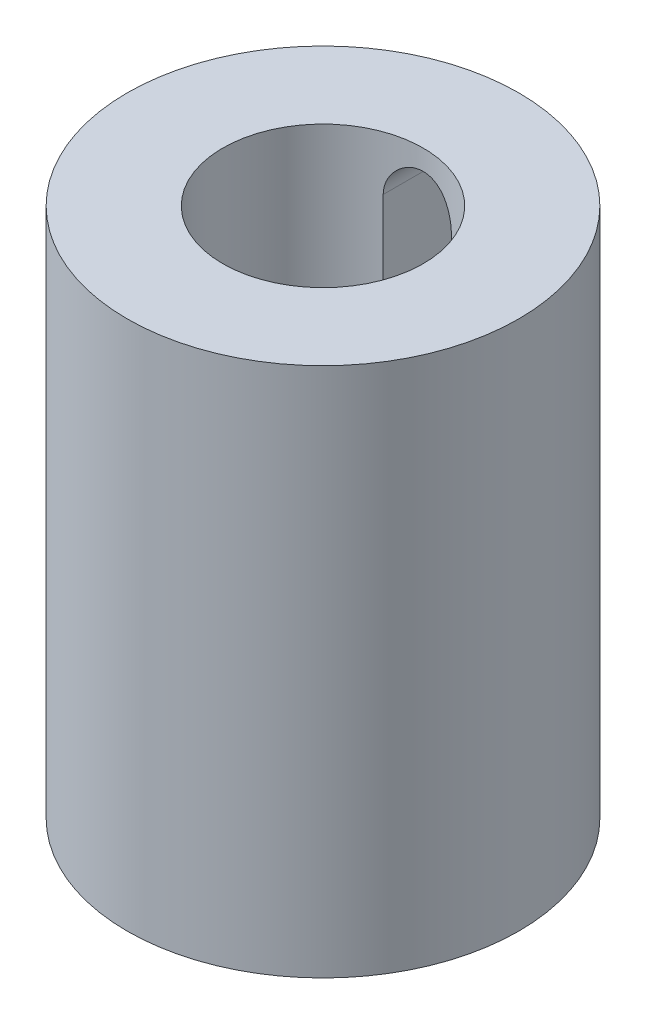
ISO-10303-21;
HEADER;
FILE_DESCRIPTION(('STEP AP214'),'2;1');
FILE_NAME('part.step','',(''),(''),'','','');
FILE_SCHEMA(('AUTOMOTIVE_DESIGN { 1 0 10303 214 1 1 1 1 }'));
ENDSEC;
DATA;
#1=APPLICATION_CONTEXT('core data for automotive mechanical design processes');
#2=APPLICATION_PROTOCOL_DEFINITION('international standard','automotive_design',2000,#1);
#3=PRODUCT_CONTEXT('',#1,'mechanical');
#4=PRODUCT('Part','Part','',(#3));
#5=PRODUCT_RELATED_PRODUCT_CATEGORY('part','',(#4));
#6=PRODUCT_DEFINITION_FORMATION('','',#4);
#7=PRODUCT_DEFINITION_CONTEXT('part definition',#1,'design');
#8=PRODUCT_DEFINITION('design','',#6,#7);
#9=PRODUCT_DEFINITION_SHAPE('','',#8);
#10=(LENGTH_UNIT() NAMED_UNIT(*) SI_UNIT(.MILLI.,.METRE.));
#11=(NAMED_UNIT(*) PLANE_ANGLE_UNIT() SI_UNIT($,.RADIAN.));
#12=(NAMED_UNIT(*) SI_UNIT($,.STERADIAN.) SOLID_ANGLE_UNIT());
#13=UNCERTAINTY_MEASURE_WITH_UNIT(LENGTH_MEASURE(1.E-05),#10,'distance_accuracy_value','');
#14=(GEOMETRIC_REPRESENTATION_CONTEXT(3) GLOBAL_UNCERTAINTY_ASSIGNED_CONTEXT((#13)) GLOBAL_UNIT_ASSIGNED_CONTEXT((#10,
#11,#12)) REPRESENTATION_CONTEXT('',''));
#15=CARTESIAN_POINT('',(0.,0.,0.));
#16=DIRECTION('',(0.,0.,1.));
#17=DIRECTION('',(1.,0.,0.));
#18=AXIS2_PLACEMENT_3D('',#15,#16,#17);
#19=CARTESIAN_POINT('',(0.,46.0659340659341,0.));
#20=DIRECTION('',(0.,1.,0.));
#21=DIRECTION('',(0.,0.,1.));
#22=AXIS2_PLACEMENT_3D('',#19,#20,#21);
#23=CYLINDRICAL_SURFACE('',#22,15.1208791208791);
#24=DIRECTION('',(0.,1.,0.));
#25=VECTOR('',#24,1.);
#26=CARTESIAN_POINT('',(-5.14000102900412,46.0659340659341,-14.2204562096325));
#27=LINE('',#26,#25);
#28=CARTESIAN_POINT('',(-5.14000102900412,-27.1299059130508,-14.2204562096325));
#29=VERTEX_POINT('',#28);
#30=CARTESIAN_POINT('',(-5.14000102900412,37.869690432897,-14.2204562096325));
#31=VERTEX_POINT('',#30);
#32=EDGE_CURVE('E146',#29,#31,#27,.T.);
#33=ORIENTED_EDGE('',*,*,#32,.T.);
#34=CARTESIAN_POINT('',(-5.14000102900412,37.869690432897,-14.2204562096325));
#35=CARTESIAN_POINT('',(-5.14002102747468,38.0097456835956,-14.2204326730949));
#36=CARTESIAN_POINT('',(-5.13427755583523,38.1497917412132,-14.2225245124609));
#37=CARTESIAN_POINT('',(-5.11141314304525,38.4287937767093,-14.2307663990674));
#38=CARTESIAN_POINT('',(-5.09429538339667,38.5677500484181,-14.2369153115006));
#39=CARTESIAN_POINT('',(-5.04890085093638,38.8431608208899,-14.2530743677835));
#40=CARTESIAN_POINT('',(-5.02065817662554,38.979621645345,-14.2630727108123));
#41=CARTESIAN_POINT('',(-4.95328564871349,39.2495156104828,-14.2866100569386));
#42=CARTESIAN_POINT('',(-4.91415537816541,39.3829486350024,-14.3001491956318));
#43=CARTESIAN_POINT('',(-4.82538320930365,39.6457832974603,-14.330347301387));
#44=CARTESIAN_POINT('',(-4.77575029456977,39.7751882730172,-14.3470036007445));
#45=CARTESIAN_POINT('',(-4.6663614594846,40.029283976328,-14.3829540597943));
#46=CARTESIAN_POINT('',(-4.60660175959951,40.1539729226274,-14.4022492038396));
#47=CARTESIAN_POINT('',(-4.4127400429123,40.5198620039076,-14.4633017502006));
#48=CARTESIAN_POINT('',(-4.26402041493811,40.7529873304385,-14.5082387607293));
#49=CARTESIAN_POINT('',(-3.92561913127901,41.1999558273327,-14.6035076613199));
#50=CARTESIAN_POINT('',(-3.73463306729003,41.4127756385541,-14.6539771166196));
#51=CARTESIAN_POINT('',(-3.31982835608129,41.8041059012354,-14.7534796862771));
#52=CARTESIAN_POINT('',(-3.09600380511982,41.9826101700474,-14.8025125404556));
#53=CARTESIAN_POINT('',(-2.61436226279878,42.3048828419447,-14.8952264182547));
#54=CARTESIAN_POINT('',(-2.35578477538183,42.4475713140269,-14.93872504509));
#55=CARTESIAN_POINT('',(-1.81657139185364,42.6870150509466,-15.013827194864));
#56=CARTESIAN_POINT('',(-1.53594248918091,42.7837848105721,-15.0454344707955));
#57=CARTESIAN_POINT('',(-0.971326294640556,42.9251577160523,-15.0922106594478));
#58=CARTESIAN_POINT('',(-0.687825089352467,42.9715163009993,-15.1079312846667));
#59=CARTESIAN_POINT('',(-0.116655283981176,43.0163402400381,-15.1231248153739));
#60=CARTESIAN_POINT('',(0.17101226219471,43.0148175016558,-15.1226017604763));
#61=CARTESIAN_POINT('',(0.729890627241207,42.9650198309119,-15.1057366447944));
#62=CARTESIAN_POINT('',(1.00129422534417,42.918653533909,-15.0900404001605));
#63=CARTESIAN_POINT('',(1.53220659944929,42.7836493874731,-15.0454090760822));
#64=CARTESIAN_POINT('',(1.79171471045486,42.6950091779417,-15.0164732574929));
#65=CARTESIAN_POINT('',(2.29557211653941,42.4768974815611,-14.9478061617687));
#66=CARTESIAN_POINT('',(2.53967137277207,42.3468942268727,-14.907935279212));
#67=CARTESIAN_POINT('',(3.00314737485387,42.0501770156733,-14.8215299353922));
#68=CARTESIAN_POINT('',(3.22251714533484,41.8834527403556,-14.7749936023892));
#69=CARTESIAN_POINT('',(3.64160886564896,41.5085354750811,-14.6774736065265));
#70=CARTESIAN_POINT('',(3.8398513722678,41.2987169525339,-14.6263837334253));
#71=CARTESIAN_POINT('',(4.19892272918298,40.8482026909545,-14.527381935341));
#72=CARTESIAN_POINT('',(4.35973917195641,40.6074967530099,-14.4794710680172));
#73=CARTESIAN_POINT('',(4.57041143630591,40.2260842636933,-14.4138074667288));
#74=CARTESIAN_POINT('',(4.63595646841574,40.0943734095877,-14.3928056388513));
#75=CARTESIAN_POINT('',(4.75564308994047,39.8254739464858,-14.3537037021023));
#76=CARTESIAN_POINT('',(4.80978944310016,39.6882876544182,-14.3356023818069));
#77=CARTESIAN_POINT('',(4.90613528516274,39.4095525301411,-14.3029162289376));
#78=CARTESIAN_POINT('',(4.94834788681859,39.2680086772034,-14.2883275393364));
#79=CARTESIAN_POINT('',(5.02048027601976,38.9815330159393,-14.2631418908777));
#80=CARTESIAN_POINT('',(5.05040566601571,38.8366027835902,-14.2525431129724));
#81=CARTESIAN_POINT('',(5.09596608253602,38.5549576530151,-14.236315771625));
#82=CARTESIAN_POINT('',(5.11247341077117,38.4184007077077,-14.2303848044642));
#83=CARTESIAN_POINT('',(5.13449289118933,38.1444629008288,-14.2224467495793));
#84=CARTESIAN_POINT('',(5.14001872716455,38.0070832788664,-14.2204347785439));
#85=CARTESIAN_POINT('',(5.14000102900412,37.869690432897,-14.2204562096325));
#86=B_SPLINE_CURVE_WITH_KNOTS('',3,(#34,#35,#36,#37,#38,#39,#40,#41,#42,#43,#44,#45,#46,#47,#48,
#49,#50,#51,#52,#53,#54,#55,#56,#57,#58,#59,#60,#61,#62,#63,#64,#65,#66,#67,#68,#69,#70,#71,#72,
#73,#74,#75,#76,#77,#78,#79,#80,#81,#82,#83,#84,#85),.UNSPECIFIED.,.F.,.F.,(4,2,2,2,2,2,2,2,2,2,
2,2,2,2,2,2,2,2,2,2,2,2,2,2,2,4),(0.,0.420018055227185,0.83991867663599,1.25854216990599,
1.67718169681495,2.09546457181133,2.513903904184,3.35045811329579,4.21775315299354,
5.08520430751073,5.97630965983812,6.8671335367256,7.72583148546545,8.58431588774411,
9.40779956365253,10.231329218985,11.0659058423869,11.9007172862593,12.7762311988733,
13.6520349505029,14.097397052609,14.5425726575062,14.9872571871659,15.4317387336603,
15.8442830974467,16.2563130757805),.UNSPECIFIED.);
#87=CARTESIAN_POINT('',(5.14000102900412,37.869690432897,-14.2204562096325));
#88=VERTEX_POINT('',#87);
#89=EDGE_CURVE('E86',#31,#88,#86,.T.);
#90=ORIENTED_EDGE('',*,*,#89,.T.);
#91=DIRECTION('',(0.,1.,0.));
#92=VECTOR('',#91,1.);
#93=CARTESIAN_POINT('',(5.14000102900412,46.0659340659341,-14.2204562096325));
#94=LINE('',#93,#92);
#95=CARTESIAN_POINT('',(5.14000102900412,-27.1299059130508,-14.2204562096325));
#96=VERTEX_POINT('',#95);
#97=EDGE_CURVE('E118',#88,#96,#94,.F.);
#98=ORIENTED_EDGE('',*,*,#97,.T.);
#99=CARTESIAN_POINT('',(5.14000102900412,-27.1299059130508,-14.2204562096325));
#100=CARTESIAN_POINT('',(5.14002102747468,-27.2699611637494,-14.2204326730949));
#101=CARTESIAN_POINT('',(5.13427755583523,-27.410007221367,-14.2225245124609));
#102=CARTESIAN_POINT('',(5.11141314304525,-27.6890092568631,-14.2307663990674));
#103=CARTESIAN_POINT('',(5.09429538339667,-27.8279655285719,-14.2369153115006));
#104=CARTESIAN_POINT('',(5.04890085093638,-28.1033763010438,-14.2530743677835));
#105=CARTESIAN_POINT('',(5.02065817662554,-28.2398371254988,-14.2630727108123));
#106=CARTESIAN_POINT('',(4.95328564871349,-28.5097310906366,-14.2866100569386));
#107=CARTESIAN_POINT('',(4.91415537816541,-28.6431641151562,-14.3001491956318));
#108=CARTESIAN_POINT('',(4.82538320930365,-28.9059987776141,-14.330347301387));
#109=CARTESIAN_POINT('',(4.77575029456977,-29.035403753171,-14.3470036007445));
#110=CARTESIAN_POINT('',(4.6663614594846,-29.2894994564818,-14.3829540597943));
#111=CARTESIAN_POINT('',(4.60660175959951,-29.4141884027812,-14.4022492038396));
#112=CARTESIAN_POINT('',(4.4127400429123,-29.7800774840614,-14.4633017502006));
#113=CARTESIAN_POINT('',(4.26402041493811,-30.0132028105923,-14.5082387607293));
#114=CARTESIAN_POINT('',(3.92561913127901,-30.4601713074865,-14.6035076613199));
#115=CARTESIAN_POINT('',(3.73463306729003,-30.6729911187079,-14.6539771166196));
#116=CARTESIAN_POINT('',(3.31982835608129,-31.0643213813892,-14.7534796862771));
#117=CARTESIAN_POINT('',(3.09600380511982,-31.2428256502012,-14.8025125404556));
#118=CARTESIAN_POINT('',(2.61436226279878,-31.5650983220985,-14.8952264182547));
#119=CARTESIAN_POINT('',(2.35578477538183,-31.7077867941807,-14.93872504509));
#120=CARTESIAN_POINT('',(1.81657139185364,-31.9472305311004,-15.013827194864));
#121=CARTESIAN_POINT('',(1.53594248918091,-32.0440002907259,-15.0454344707955));
#122=CARTESIAN_POINT('',(0.971326294640557,-32.1853731962061,-15.0922106594478));
#123=CARTESIAN_POINT('',(0.687825089352468,-32.2317317811531,-15.1079312846667));
#124=CARTESIAN_POINT('',(0.116655283981177,-32.2765557201919,-15.1231248153739));
#125=CARTESIAN_POINT('',(-0.171012262194709,-32.2750329818096,-15.1226017604763));
#126=CARTESIAN_POINT('',(-0.729890627241205,-32.2252353110658,-15.1057366447944));
#127=CARTESIAN_POINT('',(-1.00129422534417,-32.1788690140628,-15.0900404001605));
#128=CARTESIAN_POINT('',(-1.53220659944929,-32.0438648676269,-15.0454090760822));
#129=CARTESIAN_POINT('',(-1.79171471045486,-31.9552246580955,-15.0164732574929));
#130=CARTESIAN_POINT('',(-2.29557211653941,-31.7371129617149,-14.9478061617687));
#131=CARTESIAN_POINT('',(-2.53967137277207,-31.6071097070265,-14.907935279212));
#132=CARTESIAN_POINT('',(-3.00314737485387,-31.3103924958271,-14.8215299353922));
#133=CARTESIAN_POINT('',(-3.22251714533484,-31.1436682205094,-14.7749936023892));
#134=CARTESIAN_POINT('',(-3.64160886564896,-30.7687509552349,-14.6774736065265));
#135=CARTESIAN_POINT('',(-3.8398513722678,-30.5589324326877,-14.6263837334253));
#136=CARTESIAN_POINT('',(-4.19892272918298,-30.1084181711083,-14.527381935341));
#137=CARTESIAN_POINT('',(-4.35973917195641,-29.8677122331637,-14.4794710680172));
#138=CARTESIAN_POINT('',(-4.57041143630591,-29.4862997438471,-14.4138074667288));
#139=CARTESIAN_POINT('',(-4.63595646841574,-29.3545888897415,-14.3928056388513));
#140=CARTESIAN_POINT('',(-4.75564308994046,-29.0856894266396,-14.3537037021023));
#141=CARTESIAN_POINT('',(-4.80978944310016,-28.948503134572,-14.3356023818069));
#142=CARTESIAN_POINT('',(-4.90613528516274,-28.6697680102949,-14.3029162289376));
#143=CARTESIAN_POINT('',(-4.94834788681858,-28.5282241573572,-14.2883275393364));
#144=CARTESIAN_POINT('',(-5.02048027601976,-28.2417484960932,-14.2631418908777));
#145=CARTESIAN_POINT('',(-5.05040566601571,-28.096818263744,-14.2525431129724));
#146=CARTESIAN_POINT('',(-5.09596608253602,-27.8151731331689,-14.236315771625));
#147=CARTESIAN_POINT('',(-5.11247341077116,-27.6786161878615,-14.2303848044642));
#148=CARTESIAN_POINT('',(-5.13449289118933,-27.4046783809826,-14.2224467495793));
#149=CARTESIAN_POINT('',(-5.14001872716455,-27.2672987590202,-14.2204347785439));
#150=CARTESIAN_POINT('',(-5.14000102900412,-27.1299059130508,-14.2204562096325));
#151=B_SPLINE_CURVE_WITH_KNOTS('',3,(#99,#100,#101,#102,#103,#104,#105,#106,#107,#108,#109,#110,
#111,#112,#113,#114,#115,#116,#117,#118,#119,#120,#121,#122,#123,#124,#125,#126,#127,#128,#129,
#130,#131,#132,#133,#134,#135,#136,#137,#138,#139,#140,#141,#142,#143,#144,#145,#146,#147,#148,
#149,#150),.UNSPECIFIED.,.F.,.F.,(4,2,2,2,2,2,2,2,2,2,2,2,2,2,2,2,2,2,2,2,2,2,2,2,2,4),(0.,
0.420018055227189,0.83991867663599,1.25854216990598,1.67718169681495,2.09546457181132,
2.513903904184,3.35045811329579,4.21775315299354,5.08520430751073,5.97630965983812,
6.86713353672559,7.72583148546545,8.58431588774411,9.40779956365253,10.231329218985,
11.0659058423869,11.9007172862593,12.7762311988733,13.6520349505029,14.097397052609,
14.5425726575062,14.9872571871659,15.4317387336603,15.8442830974467,16.2563130757805),.UNSPECIFIED.);
#152=EDGE_CURVE('E139',#96,#29,#151,.T.);
#153=ORIENTED_EDGE('',*,*,#152,.T.);
#154=EDGE_LOOP('',(#33,#90,#98,#153));
#155=FACE_BOUND('',#154,.T.);
#156=CARTESIAN_POINT('',(0.,-33.9340659340659,0.));
#157=DIRECTION('',(0.,1.,0.));
#158=DIRECTION('',(0.,0.,1.));
#159=AXIS2_PLACEMENT_3D('',#156,#157,#158);
#160=CIRCLE('',#159,15.1208791208791);
#161=CARTESIAN_POINT('',(0.,-33.9340659340659,15.1208791208791));
#162=VERTEX_POINT('',#161);
#163=EDGE_CURVE('E128',#162,#162,#160,.T.);
#164=ORIENTED_EDGE('',*,*,#163,.F.);
#165=EDGE_LOOP('',(#164));
#166=FACE_BOUND('',#165,.T.);
#167=CARTESIAN_POINT('',(0.,46.0659340659341,0.));
#168=DIRECTION('',(0.,1.,0.));
#169=DIRECTION('',(0.,0.,1.));
#170=AXIS2_PLACEMENT_3D('',#167,#168,#169);
#171=CIRCLE('',#170,15.1208791208791);
#172=CARTESIAN_POINT('',(0.,46.0659340659341,15.1208791208791));
#173=VERTEX_POINT('',#172);
#174=EDGE_CURVE('E117',#173,#173,#171,.T.);
#175=ORIENTED_EDGE('',*,*,#174,.T.);
#176=EDGE_LOOP('',(#175));
#177=FACE_BOUND('',#176,.T.);
#178=ADVANCED_FACE('F37',(#155,#166,#177),#23,.F.);
#179=CARTESIAN_POINT('',(15.1208791208791,-33.9340659340659,0.));
#180=DIRECTION('',(0.,1.,0.));
#181=DIRECTION('',(0.,0.,1.));
#182=AXIS2_PLACEMENT_3D('',#179,#180,#181);
#183=PLANE('',#182);
#184=CARTESIAN_POINT('',(0.,-33.9340659340659,0.));
#185=DIRECTION('',(0.,1.,0.));
#186=DIRECTION('',(0.,0.,1.));
#187=AXIS2_PLACEMENT_3D('',#184,#185,#186);
#188=CIRCLE('',#187,29.5384615384615);
#189=CARTESIAN_POINT('',(0.,-33.9340659340659,29.5384615384615));
#190=VERTEX_POINT('',#189);
#191=EDGE_CURVE('E125',#190,#190,#188,.T.);
#192=ORIENTED_EDGE('',*,*,#191,.F.);
#193=EDGE_LOOP('',(#192));
#194=FACE_BOUND('',#193,.T.);
#195=ORIENTED_EDGE('',*,*,#163,.T.);
#196=EDGE_LOOP('',(#195));
#197=FACE_BOUND('',#196,.T.);
#198=ADVANCED_FACE('F161',(#194,#197),#183,.F.);
#199=CARTESIAN_POINT('',(0.,46.0659340659341,0.));
#200=DIRECTION('',(0.,1.,0.));
#201=DIRECTION('',(0.,0.,1.));
#202=AXIS2_PLACEMENT_3D('',#199,#200,#201);
#203=CYLINDRICAL_SURFACE('',#202,29.5384615384615);
#204=DIRECTION('',(0.,1.,0.));
#205=VECTOR('',#204,1.);
#206=CARTESIAN_POINT('',(-5.14000102900412,46.0659340659341,-29.0878170284572));
#207=LINE('',#206,#205);
#208=CARTESIAN_POINT('',(-5.14000102900412,37.869690432897,-29.0878170284572));
#209=VERTEX_POINT('',#208);
#210=CARTESIAN_POINT('',(-5.14000102900412,-27.1299059130508,-29.0878170284572));
#211=VERTEX_POINT('',#210);
#212=EDGE_CURVE('E11',#209,#211,#207,.F.);
#213=ORIENTED_EDGE('',*,*,#212,.T.);
#214=CARTESIAN_POINT('',(-5.14000102900412,-27.1299059130508,-29.0878170284572));
#215=CARTESIAN_POINT('',(-5.14001777842904,-27.2733035065593,-29.0878059921586));
#216=CARTESIAN_POINT('',(-5.13400091895856,-27.4166972118181,-29.0888770394658));
#217=CARTESIAN_POINT('',(-5.11002209420244,-27.7024369219468,-29.0931032703844));
#218=CARTESIAN_POINT('',(-5.09206138188896,-27.8447830351309,-29.0962582353817));
#219=CARTESIAN_POINT('',(-5.04434847967116,-28.1272313004461,-29.1045668055852));
#220=CARTESIAN_POINT('',(-5.01461191170945,-28.2673361706677,-29.1097177626988));
#221=CARTESIAN_POINT('',(-4.94358094199631,-28.5445017918719,-29.1218650367928));
#222=CARTESIAN_POINT('',(-4.90228653991504,-28.6815625427675,-29.1288613538259));
#223=CARTESIAN_POINT('',(-4.8084501213896,-28.9516801492994,-29.1444982003605));
#224=CARTESIAN_POINT('',(-4.75590810990015,-29.0847370066994,-29.1531387291377));
#225=CARTESIAN_POINT('',(-4.63994289594415,-29.3459771428167,-29.1718201145179));
#226=CARTESIAN_POINT('',(-4.5765156706627,-29.4741585982751,-29.1818614885693));
#227=CARTESIAN_POINT('',(-4.43927443942385,-29.7246785371214,-29.2030541055301));
#228=CARTESIAN_POINT('',(-4.36546409577195,-29.8470190604157,-29.2142049567037));
#229=CARTESIAN_POINT('',(-4.20792963785203,-30.0851258133829,-29.237311363452));
#230=CARTESIAN_POINT('',(-4.1242018333253,-30.2008895720035,-29.2492672178476));
#231=CARTESIAN_POINT('',(-3.94662306179064,-30.4260432299171,-29.2737592449157));
#232=CARTESIAN_POINT('',(-3.85268661244942,-30.5353652494733,-29.2862997208559));
#233=CARTESIAN_POINT('',(-3.65594003174314,-30.7457689758472,-29.3115105296579));
#234=CARTESIAN_POINT('',(-3.55312662704647,-30.8468476160145,-29.3241809088901));
#235=CARTESIAN_POINT('',(-3.33938176026749,-31.0400062608874,-29.3492898284823));
#236=CARTESIAN_POINT('',(-3.22845203108509,-31.1320881767172,-29.3617284176239));
#237=CARTESIAN_POINT('',(-2.99916888480842,-31.3066710170727,-29.3860339054233));
#238=CARTESIAN_POINT('',(-2.88081274576482,-31.3891683966804,-29.3979005916146));
#239=CARTESIAN_POINT('',(-2.63677255385009,-31.5444370374565,-29.4207962081558));
#240=CARTESIAN_POINT('',(-2.51104786728614,-31.6171452830686,-29.4318195301825));
#241=CARTESIAN_POINT('',(-2.25376865847815,-31.7517260878828,-29.4526382130447));
#242=CARTESIAN_POINT('',(-2.12221198005934,-31.8135945968946,-29.4624331145027));
#243=CARTESIAN_POINT('',(-1.85430526702788,-31.9259721259931,-29.4805066735367));
#244=CARTESIAN_POINT('',(-1.71795757199614,-31.9764866038093,-29.4887860592437));
#245=CARTESIAN_POINT('',(-1.44133935203798,-32.0658241497067,-29.5036005952185));
#246=CARTESIAN_POINT('',(-1.30106742069745,-32.1046429659437,-29.5101351110577));
#247=CARTESIAN_POINT('',(-1.01912145074687,-32.1699164129712,-29.5212088224335));
#248=CARTESIAN_POINT('',(-0.87747710869627,-32.1964952796312,-29.5257680379086));
#249=CARTESIAN_POINT('',(-0.592413144980606,-32.2376894996989,-29.5328660721139));
#250=CARTESIAN_POINT('',(-0.448992924127155,-32.2523006969838,-29.5354041889501));
#251=CARTESIAN_POINT('',(-0.0176287317053855,-32.2779116129139,-29.5398458486572));
#252=CARTESIAN_POINT('',(0.271739845551919,-32.2707628254913,-29.5385896011337));
#253=CARTESIAN_POINT('',(0.699699851751017,-32.2240679209676,-29.5305180510743));
#254=CARTESIAN_POINT('',(0.840654961952066,-32.2027006895476,-29.5268296038882));
#255=CARTESIAN_POINT('',(1.12024976406249,-32.1483595729092,-29.5175409402545));
#256=CARTESIAN_POINT('',(1.25889024321232,-32.1153897217688,-29.5119413882933));
#257=CARTESIAN_POINT('',(1.53291492818512,-32.0380698751282,-29.4989784838206));
#258=CARTESIAN_POINT('',(1.66829793026767,-31.9937157413274,-29.4916144899818));
#259=CARTESIAN_POINT('',(1.93479145336363,-31.8939821046741,-29.4753303786213));
#260=CARTESIAN_POINT('',(2.06590345744852,-31.8386064774816,-29.4664108082475));
#261=CARTESIAN_POINT('',(2.32369080237253,-31.7168981757351,-29.4472064884937));
#262=CARTESIAN_POINT('',(2.45033884699303,-31.6505088082702,-29.4369147326439));
#263=CARTESIAN_POINT('',(2.69755596809328,-31.5074838031425,-29.4152901471267));
#264=CARTESIAN_POINT('',(2.81812717753854,-31.4308517956201,-29.4039576867435));
#265=CARTESIAN_POINT('',(3.05247457671624,-31.267827096561,-29.380554519512));
#266=CARTESIAN_POINT('',(3.16624804812409,-31.1814305397195,-29.3684835211863));
#267=CARTESIAN_POINT('',(3.38614726121795,-30.999527543399,-29.3439423863429));
#268=CARTESIAN_POINT('',(3.49227569389795,-30.9040243371672,-29.3314723925226));
#269=CARTESIAN_POINT('',(3.69759602573226,-30.703180948806,-29.3063020099816));
#270=CARTESIAN_POINT('',(3.79667508716135,-30.5977254821389,-29.2936007819903));
#271=CARTESIAN_POINT('',(3.98557439054139,-30.3788590349224,-29.2684981669355));
#272=CARTESIAN_POINT('',(4.07539797081382,-30.2654509477496,-29.2560966730063));
#273=CARTESIAN_POINT('',(4.24525488656213,-30.031345088075,-29.2319326686547));
#274=CARTESIAN_POINT('',(4.32528170256102,-29.9106425402438,-29.2201705866061));
#275=CARTESIAN_POINT('',(4.47487524006538,-29.6628949186847,-29.1976355860192));
#276=CARTESIAN_POINT('',(4.54444591732757,-29.5358522678912,-29.1868622940063));
#277=CARTESIAN_POINT('',(4.67280096468584,-29.2759703595902,-29.1665883339287));
#278=CARTESIAN_POINT('',(4.73156048976129,-29.1431185976654,-29.1570906104259));
#279=CARTESIAN_POINT('',(4.83763528900385,-28.8728793878579,-29.1396788745615));
#280=CARTESIAN_POINT('',(4.88495499211458,-28.7354937187715,-29.1317642495066));
#281=CARTESIAN_POINT('',(4.96777127638204,-28.4572735128602,-29.1177561374666));
#282=CARTESIAN_POINT('',(5.00328028091299,-28.3164427683491,-29.1116607375824));
#283=CARTESIAN_POINT('',(5.06225207274777,-28.032268471116,-29.1014640598084));
#284=CARTESIAN_POINT('',(5.08572062959923,-27.8889261560073,-29.0973618268818));
#285=CARTESIAN_POINT('',(5.11538414264105,-27.6427704060993,-29.0921589425799));
#286=CARTESIAN_POINT('',(5.12462027388613,-27.5403240789893,-29.0905318897473));
#287=CARTESIAN_POINT('',(5.13692500631966,-27.3352237150356,-29.0883605798388));
#288=CARTESIAN_POINT('',(5.14000397664608,-27.2325703193279,-29.0878145023321));
#289=CARTESIAN_POINT('',(5.14000102900412,-27.1299059130508,-29.0878170284572));
#290=B_SPLINE_CURVE_WITH_KNOTS('',3,(#214,#215,#216,#217,#218,#219,#220,#221,#222,#223,#224,
#225,#226,#227,#228,#229,#230,#231,#232,#233,#234,#235,#236,#237,#238,#239,#240,#241,#242,#243,
#244,#245,#246,#247,#248,#249,#250,#251,#252,#253,#254,#255,#256,#257,#258,#259,#260,#261,#262,
#263,#264,#265,#266,#267,#268,#269,#270,#271,#272,#273,#274,#275,#276,#277,#278,#279,#280,#281,
#282,#283,#284,#285,#286,#287,#288,#289),.UNSPECIFIED.,.F.,.F.,(4,2,2,2,2,2,2,2,2,2,2,2,2,2,2,2,
2,2,2,2,2,2,2,2,2,2,2,2,2,2,2,2,2,2,2,2,2,4),(0.,0.430056811522902,0.860068514970067,
1.28951166232647,1.71895482193814,2.14839779237477,2.57799981384541,3.00745068542404,
3.43706185941795,3.87059724056471,4.30429317404079,4.73789677868286,5.17166024797462,
5.60809457988102,6.04469163620681,6.48107837525574,6.91762356756937,7.34963446965677,
7.78179533661944,8.64513986034777,9.07260186254688,9.49991538843573,9.92738446760064,
10.3547034938679,10.7842945665798,11.2137337877063,11.643343602065,12.0728014506308,
12.5080505217132,12.9431420509879,13.3785215656425,13.8137359510534,14.2499383363357,
14.6859715738172,15.121544697723,15.5569089080858,15.8653527459677,16.1732767015055),.UNSPECIFIED.);
#291=CARTESIAN_POINT('',(5.14000102900412,-27.1299059130508,-29.0878170284572));
#292=VERTEX_POINT('',#291);
#293=EDGE_CURVE('E60',#211,#292,#290,.T.);
#294=ORIENTED_EDGE('',*,*,#293,.T.);
#295=DIRECTION('',(0.,1.,0.));
#296=VECTOR('',#295,1.);
#297=CARTESIAN_POINT('',(5.14000102900412,46.0659340659341,-29.0878170284572));
#298=LINE('',#297,#296);
#299=CARTESIAN_POINT('',(5.14000102900412,37.869690432897,-29.0878170284572));
#300=VERTEX_POINT('',#299);
#301=EDGE_CURVE('E92',#292,#300,#298,.T.);
#302=ORIENTED_EDGE('',*,*,#301,.T.);
#303=CARTESIAN_POINT('',(5.14000102900412,37.869690432897,-29.0878170284572));
#304=CARTESIAN_POINT('',(5.14001777842904,38.0130880264055,-29.0878059921586));
#305=CARTESIAN_POINT('',(5.13400091895856,38.1564817316643,-29.0888770394658));
#306=CARTESIAN_POINT('',(5.11002209420244,38.442221441793,-29.0931032703844));
#307=CARTESIAN_POINT('',(5.09206138188896,38.5845675549771,-29.0962582353817));
#308=CARTESIAN_POINT('',(5.04434847967116,38.8670158202923,-29.1045668055852));
#309=CARTESIAN_POINT('',(5.01461191170945,39.0071206905139,-29.1097177626988));
#310=CARTESIAN_POINT('',(4.94358094199631,39.2842863117181,-29.1218650367928));
#311=CARTESIAN_POINT('',(4.90228653991504,39.4213470626137,-29.1288613538259));
#312=CARTESIAN_POINT('',(4.8084501213896,39.6914646691456,-29.1444982003605));
#313=CARTESIAN_POINT('',(4.75590810990015,39.8245215265456,-29.1531387291378));
#314=CARTESIAN_POINT('',(4.63994289594415,40.0857616626629,-29.1718201145179));
#315=CARTESIAN_POINT('',(4.5765156706627,40.2139431181213,-29.1818614885693));
#316=CARTESIAN_POINT('',(4.43927443942385,40.4644630569676,-29.2030541055301));
#317=CARTESIAN_POINT('',(4.36546409577195,40.5868035802619,-29.2142049567037));
#318=CARTESIAN_POINT('',(4.20792963785203,40.8249103332291,-29.237311363452));
#319=CARTESIAN_POINT('',(4.1242018333253,40.9406740918497,-29.2492672178476));
#320=CARTESIAN_POINT('',(3.94662306179064,41.1658277497633,-29.2737592449157));
#321=CARTESIAN_POINT('',(3.85268661244942,41.2751497693195,-29.2862997208559));
#322=CARTESIAN_POINT('',(3.65594003174313,41.4855534956934,-29.3115105296579));
#323=CARTESIAN_POINT('',(3.55312662704647,41.5866321358607,-29.3241809088901));
#324=CARTESIAN_POINT('',(3.33938176026748,41.7797907807336,-29.3492898284823));
#325=CARTESIAN_POINT('',(3.22845203108508,41.8718726965634,-29.3617284176239));
#326=CARTESIAN_POINT('',(2.99916888480841,42.0464555369189,-29.3860339054233));
#327=CARTESIAN_POINT('',(2.88081274576481,42.1289529165267,-29.3979005916146));
#328=CARTESIAN_POINT('',(2.63677255385008,42.2842215573027,-29.4207962081558));
#329=CARTESIAN_POINT('',(2.51104786728613,42.3569298029148,-29.4318195301825));
#330=CARTESIAN_POINT('',(2.25376865847814,42.491510607729,-29.4526382130447));
#331=CARTESIAN_POINT('',(2.12221198005933,42.5533791167408,-29.4624331145027));
#332=CARTESIAN_POINT('',(1.85430526702787,42.6657566458393,-29.4805066735367));
#333=CARTESIAN_POINT('',(1.71795757199613,42.7162711236555,-29.4887860592437));
#334=CARTESIAN_POINT('',(1.44133935203797,42.8056086695529,-29.5036005952185));
#335=CARTESIAN_POINT('',(1.30106742069745,42.8444274857899,-29.5101351110577));
#336=CARTESIAN_POINT('',(1.01912145074687,42.9097009328174,-29.5212088224335));
#337=CARTESIAN_POINT('',(0.877477108696266,42.9362797994774,-29.5257680379086));
#338=CARTESIAN_POINT('',(0.592413144980601,42.9774740195451,-29.5328660721139));
#339=CARTESIAN_POINT('',(0.44899292412715,42.99208521683,-29.5354041889501));
#340=CARTESIAN_POINT('',(0.0176287317053817,43.0176961327601,-29.5398458486572));
#341=CARTESIAN_POINT('',(-0.271739845551923,43.0105473453375,-29.5385896011337));
#342=CARTESIAN_POINT('',(-0.699699851751021,42.9638524408138,-29.5305180510743));
#343=CARTESIAN_POINT('',(-0.840654961952069,42.9424852093938,-29.5268296038882));
#344=CARTESIAN_POINT('',(-1.12024976406249,42.8881440927554,-29.5175409402545));
#345=CARTESIAN_POINT('',(-1.25889024321232,42.855174241615,-29.5119413882933));
#346=CARTESIAN_POINT('',(-1.53291492818513,42.7778543949744,-29.4989784838206));
#347=CARTESIAN_POINT('',(-1.66829793026768,42.7335002611736,-29.4916144899818));
#348=CARTESIAN_POINT('',(-1.93479145336364,42.6337666245203,-29.4753303786213));
#349=CARTESIAN_POINT('',(-2.06590345744853,42.5783909973278,-29.4664108082475));
#350=CARTESIAN_POINT('',(-2.32369080237254,42.4566826955813,-29.4472064884937));
#351=CARTESIAN_POINT('',(-2.45033884699304,42.3902933281164,-29.4369147326439));
#352=CARTESIAN_POINT('',(-2.69755596809329,42.2472683229887,-29.4152901471267));
#353=CARTESIAN_POINT('',(-2.81812717753854,42.1706363154663,-29.4039576867435));
#354=CARTESIAN_POINT('',(-3.05247457671624,42.0076116164072,-29.380554519512));
#355=CARTESIAN_POINT('',(-3.1662480481241,41.9212150595657,-29.3684835211863));
#356=CARTESIAN_POINT('',(-3.38614726121795,41.7393120632452,-29.3439423863429));
#357=CARTESIAN_POINT('',(-3.49227569389796,41.6438088570133,-29.3314723925226));
#358=CARTESIAN_POINT('',(-3.69759602573226,41.4429654686522,-29.3063020099816));
#359=CARTESIAN_POINT('',(-3.79667508716135,41.3375100019851,-29.2936007819903));
#360=CARTESIAN_POINT('',(-3.98557439054139,41.1186435547686,-29.2684981669355));
#361=CARTESIAN_POINT('',(-4.07539797081382,41.0052354675958,-29.2560966730063));
#362=CARTESIAN_POINT('',(-4.24525488656213,40.7711296079212,-29.2319326686547));
#363=CARTESIAN_POINT('',(-4.32528170256102,40.65042706009,-29.2201705866061));
#364=CARTESIAN_POINT('',(-4.47487524006538,40.4026794385309,-29.1976355860192));
#365=CARTESIAN_POINT('',(-4.54444591732757,40.2756367877374,-29.1868622940063));
#366=CARTESIAN_POINT('',(-4.67280096468585,40.0157548794364,-29.1665883339287));
#367=CARTESIAN_POINT('',(-4.73156048976129,39.8829031175116,-29.1570906104259));
#368=CARTESIAN_POINT('',(-4.83763528900385,39.6126639077041,-29.1396788745615));
#369=CARTESIAN_POINT('',(-4.88495499211458,39.4752782386177,-29.1317642495066));
#370=CARTESIAN_POINT('',(-4.96777127638204,39.1970580327064,-29.1177561374666));
#371=CARTESIAN_POINT('',(-5.00328028091299,39.0562272881953,-29.1116607375824));
#372=CARTESIAN_POINT('',(-5.06225207274777,38.7720529909622,-29.1014640598084));
#373=CARTESIAN_POINT('',(-5.08572062959923,38.6287106758535,-29.0973618268818));
#374=CARTESIAN_POINT('',(-5.11538414264105,38.3825549259454,-29.0921589425799));
#375=CARTESIAN_POINT('',(-5.12462027388613,38.2801085988355,-29.0905318897473));
#376=CARTESIAN_POINT('',(-5.13692500631966,38.0750082348818,-29.0883605798388));
#377=CARTESIAN_POINT('',(-5.14000397664608,37.9723548391741,-29.0878145023321));
#378=CARTESIAN_POINT('',(-5.14000102900412,37.869690432897,-29.0878170284572));
#379=B_SPLINE_CURVE_WITH_KNOTS('',3,(#303,#304,#305,#306,#307,#308,#309,#310,#311,#312,#313,
#314,#315,#316,#317,#318,#319,#320,#321,#322,#323,#324,#325,#326,#327,#328,#329,#330,#331,#332,
#333,#334,#335,#336,#337,#338,#339,#340,#341,#342,#343,#344,#345,#346,#347,#348,#349,#350,#351,
#352,#353,#354,#355,#356,#357,#358,#359,#360,#361,#362,#363,#364,#365,#366,#367,#368,#369,#370,
#371,#372,#373,#374,#375,#376,#377,#378),.UNSPECIFIED.,.F.,.F.,(4,2,2,2,2,2,2,2,2,2,2,2,2,2,2,2,
2,2,2,2,2,2,2,2,2,2,2,2,2,2,2,2,2,2,2,2,2,4),(0.,0.430056811522906,0.86006851497007,
1.28951166232648,1.71895482193814,2.14839779237477,2.57799981384542,3.00745068542404,
3.43706185941796,3.87059724056471,4.3042931740408,4.73789677868287,5.17166024797462,
5.60809457988103,6.04469163620681,6.48107837525575,6.91762356756938,7.34963446965678,
7.78179533661945,8.64513986034777,9.07260186254689,9.49991538843573,9.92738446760064,
10.3547034938679,10.7842945665799,11.2137337877064,11.643343602065,12.0728014506308,
12.5080505217132,12.9431420509879,13.3785215656425,13.8137359510534,14.2499383363357,
14.6859715738173,15.121544697723,15.5569089080858,15.8653527459677,16.1732767015055),.UNSPECIFIED.);
#380=EDGE_CURVE('E45',#300,#209,#379,.T.);
#381=ORIENTED_EDGE('',*,*,#380,.T.);
#382=EDGE_LOOP('',(#213,#294,#302,#381));
#383=FACE_BOUND('',#382,.T.);
#384=CARTESIAN_POINT('',(0.,46.0659340659341,0.));
#385=DIRECTION('',(0.,1.,0.));
#386=DIRECTION('',(0.,0.,1.));
#387=AXIS2_PLACEMENT_3D('',#384,#385,#386);
#388=CIRCLE('',#387,29.5384615384615);
#389=CARTESIAN_POINT('',(0.,46.0659340659341,29.5384615384615));
#390=VERTEX_POINT('',#389);
#391=EDGE_CURVE('E122',#390,#390,#388,.T.);
#392=ORIENTED_EDGE('',*,*,#391,.F.);
#393=EDGE_LOOP('',(#392));
#394=FACE_BOUND('',#393,.T.);
#395=ORIENTED_EDGE('',*,*,#191,.T.);
#396=EDGE_LOOP('',(#395));
#397=FACE_BOUND('',#396,.T.);
#398=ADVANCED_FACE('F90',(#383,#394,#397),#203,.T.);
#399=CARTESIAN_POINT('',(15.1208791208791,46.0659340659341,0.));
#400=DIRECTION('',(0.,-1.,0.));
#401=DIRECTION('',(0.,0.,-1.));
#402=AXIS2_PLACEMENT_3D('',#399,#400,#401);
#403=PLANE('',#402);
#404=ORIENTED_EDGE('',*,*,#174,.F.);
#405=EDGE_LOOP('',(#404));
#406=FACE_BOUND('',#405,.T.);
#407=ORIENTED_EDGE('',*,*,#391,.T.);
#408=EDGE_LOOP('',(#407));
#409=FACE_BOUND('',#408,.T.);
#410=ADVANCED_FACE('F107',(#406,#409),#403,.F.);
#411=CARTESIAN_POINT('',(0.,37.869690432897,-29.5384615384615));
#412=DIRECTION('',(0.,0.,1.));
#413=DIRECTION('',(1.,0.,0.));
#414=AXIS2_PLACEMENT_3D('',#411,#412,#413);
#415=CYLINDRICAL_SURFACE('',#414,5.14000102900412);
#416=DIRECTION('',(0.,0.,1.));
#417=VECTOR('',#416,1.);
#418=CARTESIAN_POINT('',(-5.14000102900412,37.869690432897,-29.5384615384615));
#419=LINE('',#418,#417);
#420=EDGE_CURVE('E52',#209,#31,#419,.T.);
#421=ORIENTED_EDGE('',*,*,#420,.F.);
#422=ORIENTED_EDGE('',*,*,#380,.F.);
#423=DIRECTION('',(0.,0.,1.));
#424=VECTOR('',#423,1.);
#425=CARTESIAN_POINT('',(5.14000102900412,37.869690432897,-29.5384615384615));
#426=LINE('',#425,#424);
#427=EDGE_CURVE('E147',#300,#88,#426,.T.);
#428=ORIENTED_EDGE('',*,*,#427,.T.);
#429=ORIENTED_EDGE('',*,*,#89,.F.);
#430=EDGE_LOOP('',(#421,#422,#428,#429));
#431=FACE_BOUND('',#430,.T.);
#432=ADVANCED_FACE('F82',(#431),#415,.F.);
#433=CARTESIAN_POINT('',(5.14000102900412,37.869690432897,-29.5384615384615));
#434=DIRECTION('',(1.,0.,0.));
#435=DIRECTION('',(0.,0.,-1.));
#436=AXIS2_PLACEMENT_3D('',#433,#434,#435);
#437=PLANE('',#436);
#438=ORIENTED_EDGE('',*,*,#427,.F.);
#439=ORIENTED_EDGE('',*,*,#301,.F.);
#440=DIRECTION('',(0.,0.,1.));
#441=VECTOR('',#440,1.);
#442=CARTESIAN_POINT('',(5.14000102900412,-27.1299059130508,-29.5384615384615));
#443=LINE('',#442,#441);
#444=EDGE_CURVE('E150',#292,#96,#443,.T.);
#445=ORIENTED_EDGE('',*,*,#444,.T.);
#446=ORIENTED_EDGE('',*,*,#97,.F.);
#447=EDGE_LOOP('',(#438,#439,#445,#446));
#448=FACE_BOUND('',#447,.T.);
#449=ADVANCED_FACE('F106',(#448),#437,.F.);
#450=CARTESIAN_POINT('',(0.,-27.1299059130508,-29.5384615384615));
#451=DIRECTION('',(0.,0.,1.));
#452=DIRECTION('',(1.,0.,0.));
#453=AXIS2_PLACEMENT_3D('',#450,#451,#452);
#454=CYLINDRICAL_SURFACE('',#453,5.14000102900412);
#455=ORIENTED_EDGE('',*,*,#444,.F.);
#456=ORIENTED_EDGE('',*,*,#293,.F.);
#457=DIRECTION('',(0.,0.,1.));
#458=VECTOR('',#457,1.);
#459=CARTESIAN_POINT('',(-5.14000102900412,-27.1299059130508,-29.5384615384615));
#460=LINE('',#459,#458);
#461=EDGE_CURVE('E78',#211,#29,#460,.T.);
#462=ORIENTED_EDGE('',*,*,#461,.T.);
#463=ORIENTED_EDGE('',*,*,#152,.F.);
#464=EDGE_LOOP('',(#455,#456,#462,#463));
#465=FACE_BOUND('',#464,.T.);
#466=ADVANCED_FACE('F134',(#465),#454,.F.);
#467=CARTESIAN_POINT('',(-5.14000102900412,37.869690432897,-29.5384615384615));
#468=DIRECTION('',(-1.,0.,0.));
#469=DIRECTION('',(0.,0.,1.));
#470=AXIS2_PLACEMENT_3D('',#467,#468,#469);
#471=PLANE('',#470);
#472=ORIENTED_EDGE('',*,*,#461,.F.);
#473=ORIENTED_EDGE('',*,*,#212,.F.);
#474=ORIENTED_EDGE('',*,*,#420,.T.);
#475=ORIENTED_EDGE('',*,*,#32,.F.);
#476=EDGE_LOOP('',(#472,#473,#474,#475));
#477=FACE_BOUND('',#476,.T.);
#478=ADVANCED_FACE('F77',(#477),#471,.F.);
#479=CLOSED_SHELL('',(#178,#198,#398,#410,#432,#449,#466,#478));
#480=MANIFOLD_SOLID_BREP('B2',#479);
#481=ADVANCED_BREP_SHAPE_REPRESENTATION('',(#18,#480),#14);
#482=SHAPE_DEFINITION_REPRESENTATION(#9,#481);
ENDSEC;
END-ISO-10303-21;
